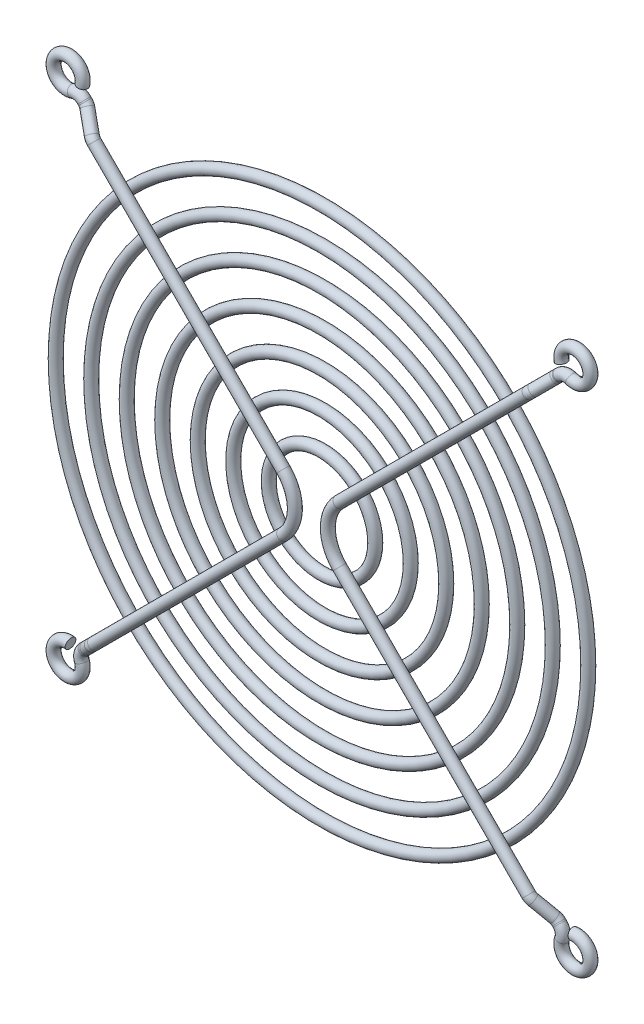
ISO-10303-21;
HEADER;
FILE_DESCRIPTION(('STEP AP214'),'2;1');
FILE_NAME('part.step','',(''),(''),'','','');
FILE_SCHEMA(('AUTOMOTIVE_DESIGN { 1 0 10303 214 1 1 1 1 }'));
ENDSEC;
DATA;
#1=APPLICATION_CONTEXT('core data for automotive mechanical design processes');
#2=APPLICATION_PROTOCOL_DEFINITION('international standard','automotive_design',2000,#1);
#3=PRODUCT_CONTEXT('',#1,'mechanical');
#4=PRODUCT('Part','Part','',(#3));
#5=PRODUCT_RELATED_PRODUCT_CATEGORY('part','',(#4));
#6=PRODUCT_DEFINITION_FORMATION('','',#4);
#7=PRODUCT_DEFINITION_CONTEXT('part definition',#1,'design');
#8=PRODUCT_DEFINITION('design','',#6,#7);
#9=PRODUCT_DEFINITION_SHAPE('','',#8);
#10=(LENGTH_UNIT() NAMED_UNIT(*) SI_UNIT(.MILLI.,.METRE.));
#11=(NAMED_UNIT(*) PLANE_ANGLE_UNIT() SI_UNIT($,.RADIAN.));
#12=(NAMED_UNIT(*) SI_UNIT($,.STERADIAN.) SOLID_ANGLE_UNIT());
#13=UNCERTAINTY_MEASURE_WITH_UNIT(LENGTH_MEASURE(1.E-05),#10,'distance_accuracy_value','');
#14=(GEOMETRIC_REPRESENTATION_CONTEXT(3) GLOBAL_UNCERTAINTY_ASSIGNED_CONTEXT((#13)) GLOBAL_UNIT_ASSIGNED_CONTEXT((#10,
#11,#12)) REPRESENTATION_CONTEXT('',''));
#15=CARTESIAN_POINT('',(0.,0.,0.));
#16=DIRECTION('',(0.,0.,1.));
#17=DIRECTION('',(1.,0.,0.));
#18=AXIS2_PLACEMENT_3D('',#15,#16,#17);
#19=CARTESIAN_POINT('',(35.4170650177825,-33.7272162009706,0.));
#20=DIRECTION('',(0.986723804404589,0.162407308398774,0.));
#21=DIRECTION('',(0.162407308398774,-0.986723804404589,0.));
#22=AXIS2_PLACEMENT_3D('',#19,#20,#21);
#23=PLANE('',#22);
#24=CARTESIAN_POINT('',(35.4170650177825,-33.7272162009706,0.));
#25=DIRECTION('',(-0.986723804404589,-0.162407308398774,0.));
#26=DIRECTION('',(0.162407308398774,-0.986723804404589,0.));
#27=AXIS2_PLACEMENT_3D('',#24,#25,#26);
#28=CIRCLE('',#27,0.75);
#29=CARTESIAN_POINT('',(35.5388704990816,-34.4672590542741,0.));
#30=VERTEX_POINT('',#29);
#31=EDGE_CURVE('E155',#30,#30,#28,.T.);
#32=ORIENTED_EDGE('',*,*,#31,.T.);
#33=EDGE_LOOP('',(#32));
#34=FACE_BOUND('',#33,.T.);
#35=ADVANCED_FACE('F143',(#34),#23,.F.);
#36=CARTESIAN_POINT('',(33.7560533293205,35.2738942612335,0.));
#37=DIRECTION('',(0.232246701837298,-0.972656912526559,0.));
#38=DIRECTION('',(-0.972656912526559,-0.232246701837298,0.));
#39=AXIS2_PLACEMENT_3D('',#36,#37,#38);
#40=PLANE('',#39);
#41=CARTESIAN_POINT('',(33.7560533293205,35.2738942612335,0.));
#42=DIRECTION('',(-0.232246701837298,0.972656912526559,0.));
#43=DIRECTION('',(-0.972656912526559,-0.232246701837298,0.));
#44=AXIS2_PLACEMENT_3D('',#41,#42,#43);
#45=CIRCLE('',#44,0.75);
#46=CARTESIAN_POINT('',(33.0265606449256,35.0997092348555,0.));
#47=VERTEX_POINT('',#46);
#48=EDGE_CURVE('E13',#47,#47,#45,.T.);
#49=ORIENTED_EDGE('',*,*,#48,.F.);
#50=EDGE_LOOP('',(#49));
#51=FACE_BOUND('',#50,.T.);
#52=ADVANCED_FACE('F161',(#51),#40,.T.);
#53=CARTESIAN_POINT('',(35.75,-35.75,0.));
#54=DIRECTION('',(0.,0.,1.));
#55=DIRECTION('',(-1.,0.,0.));
#56=AXIS2_PLACEMENT_3D('',#53,#54,#55);
#57=TOROIDAL_SURFACE('',#56,2.04999999999998,0.75);
#58=CARTESIAN_POINT('',(33.8236943839283,-35.0486821879557,0.));
#59=DIRECTION('',(-0.342106249777711,-0.939661276132538,0.));
#60=DIRECTION('',(0.939661276132539,-0.342106249777711,0.));
#61=AXIS2_PLACEMENT_3D('',#58,#59,#60);
#62=CIRCLE('',#61,0.75);
#63=CARTESIAN_POINT('',(34.5284403410277,-35.3052618752889,0.));
#64=VERTEX_POINT('',#63);
#65=EDGE_CURVE('E232',#64,#64,#62,.T.);
#66=ORIENTED_EDGE('',*,*,#65,.T.);
#67=EDGE_LOOP('',(#66));
#68=FACE_BOUND('',#67,.T.);
#69=ORIENTED_EDGE('',*,*,#31,.F.);
#70=EDGE_LOOP('',(#69));
#71=FACE_BOUND('',#70,.T.);
#72=ADVANCED_FACE('F163',(#68,#71),#57,.T.);
#73=CARTESIAN_POINT('',(32.4142024697295,-34.5355228132891,0.));
#74=DIRECTION('',(0.,0.,-1.));
#75=DIRECTION('',(1.,0.,0.));
#76=AXIS2_PLACEMENT_3D('',#73,#74,#75);
#77=TOROIDAL_SURFACE('',#76,1.49999999999998,0.75);
#78=CARTESIAN_POINT('',(33.4748626415095,-33.4748626415096,0.));
#79=DIRECTION('',(0.707106781186385,-0.70710678118671,0.));
#80=DIRECTION('',(0.70710678118671,0.707106781186386,0.));
#81=AXIS2_PLACEMENT_3D('',#78,#79,#80);
#82=CIRCLE('',#81,0.75);
#83=CARTESIAN_POINT('',(34.0051927273996,-32.9445325556198,0.));
#84=VERTEX_POINT('',#83);
#85=EDGE_CURVE('E229',#84,#84,#82,.T.);
#86=CARTESIAN_POINT('',(32.4142024697295,-34.5355228132891,0.));
#87=DIRECTION('',(0.,0.,-1.));
#88=DIRECTION('',(1.,0.,0.));
#89=AXIS2_PLACEMENT_3D('',#86,#87,#88);
#90=CIRCLE('',#89,2.24999999999998);
#91=EDGE_CURVE('',#84,#64,#90,.T.);
#92=ORIENTED_EDGE('',*,*,#85,.T.);
#93=ORIENTED_EDGE('',*,*,#65,.F.);
#94=ORIENTED_EDGE('',*,*,#91,.T.);
#95=ORIENTED_EDGE('',*,*,#91,.F.);
#96=EDGE_LOOP('',(#92,#94,#93,#95));
#97=FACE_BOUND('',#96,.T.);
#98=ADVANCED_FACE('F168',(#97),#77,.T.);
#99=CARTESIAN_POINT('',(33.4748626415095,-33.4748626415096,0.));
#100=DIRECTION('',(-0.707106781186403,0.707106781186691,0.));
#101=DIRECTION('',(0.707106781186692,0.707106781186404,0.));
#102=AXIS2_PLACEMENT_3D('',#99,#100,#101);
#103=CYLINDRICAL_SURFACE('',#102,0.75);
#104=CARTESIAN_POINT('',(33.3556075318585,-33.3556075318585,0.));
#105=DIRECTION('',(0.707106781186403,-0.707106781186692,0.));
#106=DIRECTION('',(0.707106781186692,0.707106781186404,0.));
#107=AXIS2_PLACEMENT_3D('',#104,#105,#106);
#108=CIRCLE('',#107,0.75);
#109=CARTESIAN_POINT('',(33.3556075318587,-33.3556075318583,-0.75));
#110=VERTEX_POINT('',#109);
#111=EDGE_CURVE('E234',#110,#110,#108,.T.);
#112=ORIENTED_EDGE('',*,*,#111,.T.);
#113=EDGE_LOOP('',(#112));
#114=FACE_BOUND('',#113,.T.);
#115=ORIENTED_EDGE('',*,*,#85,.F.);
#116=EDGE_LOOP('',(#115));
#117=FACE_BOUND('',#116,.T.);
#118=ADVANCED_FACE('F217',(#114,#117),#103,.T.);
#119=CARTESIAN_POINT('',(33.355607531858,-33.355607531859,1.5));
#120=DIRECTION('',(-0.707106781186693,-0.707106781186402,-4.36572074787497E-13));
#121=DIRECTION('',(-0.707106781186402,0.707106781186693,0.));
#122=AXIS2_PLACEMENT_3D('',#119,#120,#121);
#123=TOROIDAL_SURFACE('',#122,1.5,0.75);
#124=CARTESIAN_POINT('',(32.9088128371524,-32.9088128371524,0.139577638538332));
#125=DIRECTION('',(0.641309251378241,-0.641309251378246,-0.421242077899814));
#126=DIRECTION('',(0.707106781186564,0.707106781186532,0.));
#127=AXIS2_PLACEMENT_3D('',#124,#125,#126);
#128=CIRCLE('',#127,0.75);
#129=CARTESIAN_POINT('',(32.6854154897996,-32.6854154897991,-0.540633542192506));
#130=VERTEX_POINT('',#129);
#131=EDGE_CURVE('E240',#130,#130,#128,.T.);
#132=CARTESIAN_POINT('',(33.355607531858,-33.355607531859,1.5));
#133=DIRECTION('',(-0.707106781186693,-0.707106781186402,-4.36572074787497E-13));
#134=DIRECTION('',(-0.707106781186402,0.707106781186693,0.));
#135=AXIS2_PLACEMENT_3D('',#132,#133,#134);
#136=CIRCLE('',#135,2.25);
#137=EDGE_CURVE('',#130,#110,#136,.T.);
#138=ORIENTED_EDGE('',*,*,#131,.T.);
#139=ORIENTED_EDGE('',*,*,#111,.F.);
#140=ORIENTED_EDGE('',*,*,#137,.T.);
#141=ORIENTED_EDGE('',*,*,#137,.F.);
#142=EDGE_LOOP('',(#138,#140,#139,#141));
#143=FACE_BOUND('',#142,.T.);
#144=ADVANCED_FACE('F213',(#143),#123,.T.);
#145=CARTESIAN_POINT('',(32.9088128371524,-32.9088128371524,0.13957763853833));
#146=DIRECTION('',(-0.641309251378243,0.641309251378244,0.421242077899815));
#147=DIRECTION('',(0.707106781186548,0.707106781186547,0.));
#148=AXIS2_PLACEMENT_3D('',#145,#146,#147);
#149=CYLINDRICAL_SURFACE('',#148,0.75);
#150=CARTESIAN_POINT('',(31.0501689447603,-31.0501689447603,1.36042236146167));
#151=DIRECTION('',(0.641309251378243,-0.641309251378244,-0.421242077899815));
#152=DIRECTION('',(0.707106781186562,0.707106781186533,0.));
#153=AXIS2_PLACEMENT_3D('',#150,#151,#152);
#154=CIRCLE('',#153,0.75);
#155=CARTESIAN_POINT('',(31.2735662921134,-31.2735662921133,2.04063354219252));
#156=VERTEX_POINT('',#155);
#157=EDGE_CURVE('E243',#156,#156,#154,.T.);
#158=ORIENTED_EDGE('',*,*,#157,.T.);
#159=EDGE_LOOP('',(#158));
#160=FACE_BOUND('',#159,.T.);
#161=ORIENTED_EDGE('',*,*,#131,.F.);
#162=EDGE_LOOP('',(#161));
#163=FACE_BOUND('',#162,.T.);
#164=ADVANCED_FACE('F209',(#160,#163),#149,.T.);
#165=CARTESIAN_POINT('',(30.6033742500542,-30.6033742500542,0.));
#166=DIRECTION('',(0.707106781186545,0.70710678118655,0.));
#167=DIRECTION('',(0.70710678118655,-0.707106781186545,0.));
#168=AXIS2_PLACEMENT_3D('',#165,#166,#167);
#169=TOROIDAL_SURFACE('',#168,1.5,0.75);
#170=CARTESIAN_POINT('',(30.6033742500542,-30.6033742500542,1.5));
#171=DIRECTION('',(0.70710678118655,-0.707106781186545,0.));
#172=DIRECTION('',(0.707106781186546,0.70710678118655,0.));
#173=AXIS2_PLACEMENT_3D('',#170,#171,#172);
#174=CIRCLE('',#173,0.75);
#175=CARTESIAN_POINT('',(30.6033742500542,-30.6033742500542,2.25));
#176=VERTEX_POINT('',#175);
#177=EDGE_CURVE('E246',#176,#176,#174,.T.);
#178=CARTESIAN_POINT('',(30.6033742500542,-30.6033742500542,0.));
#179=DIRECTION('',(0.707106781186545,0.70710678118655,0.));
#180=DIRECTION('',(0.70710678118655,-0.707106781186545,0.));
#181=AXIS2_PLACEMENT_3D('',#178,#179,#180);
#182=CIRCLE('',#181,2.25);
#183=EDGE_CURVE('',#176,#156,#182,.T.);
#184=ORIENTED_EDGE('',*,*,#177,.T.);
#185=ORIENTED_EDGE('',*,*,#157,.F.);
#186=ORIENTED_EDGE('',*,*,#183,.T.);
#187=ORIENTED_EDGE('',*,*,#183,.F.);
#188=EDGE_LOOP('',(#184,#186,#185,#187));
#189=FACE_BOUND('',#188,.T.);
#190=ADVANCED_FACE('F205',(#189),#169,.T.);
#191=CARTESIAN_POINT('',(30.6033742500542,-30.6033742500542,1.5));
#192=DIRECTION('',(-0.707106781186548,0.707106781186547,0.));
#193=DIRECTION('',(0.707106781186547,0.707106781186548,0.));
#194=AXIS2_PLACEMENT_3D('',#191,#192,#193);
#195=CYLINDRICAL_SURFACE('',#194,0.75);
#196=CARTESIAN_POINT('',(3.96761484590761,-3.96761484590759,1.5));
#197=DIRECTION('',(0.707106781186547,-0.707106781186548,0.));
#198=DIRECTION('',(0.707106781186548,0.707106781186548,0.));
#199=AXIS2_PLACEMENT_3D('',#196,#197,#198);
#200=CIRCLE('',#199,0.75);
#201=CARTESIAN_POINT('',(3.4372847600177,-4.4979449317975,1.5));
#202=VERTEX_POINT('',#201);
#203=EDGE_CURVE('E249',#202,#202,#200,.T.);
#204=ORIENTED_EDGE('',*,*,#203,.T.);
#205=EDGE_LOOP('',(#204));
#206=FACE_BOUND('',#205,.T.);
#207=ORIENTED_EDGE('',*,*,#177,.F.);
#208=EDGE_LOOP('',(#207));
#209=FACE_BOUND('',#208,.T.);
#210=ADVANCED_FACE('F201',(#206,#209),#195,.T.);
#211=CARTESIAN_POINT('',(7.93522969181521,0.,1.5));
#212=DIRECTION('',(0.,0.,1.));
#213=DIRECTION('',(-1.,0.,0.));
#214=AXIS2_PLACEMENT_3D('',#211,#212,#213);
#215=TOROIDAL_SURFACE('',#214,5.61105472535535,0.75);
#216=CARTESIAN_POINT('',(3.96761484590762,3.9676148459076,1.5));
#217=DIRECTION('',(-0.707106781186548,-0.707106781186547,0.));
#218=DIRECTION('',(0.707106781186548,-0.707106781186548,0.));
#219=AXIS2_PLACEMENT_3D('',#216,#217,#218);
#220=CIRCLE('',#219,0.75);
#221=CARTESIAN_POINT('',(3.43728476001771,4.4979449317975,1.5));
#222=VERTEX_POINT('',#221);
#223=EDGE_CURVE('E252',#222,#222,#220,.T.);
#224=CARTESIAN_POINT('',(7.93522969181521,0.,1.5));
#225=DIRECTION('',(0.,0.,1.));
#226=DIRECTION('',(-1.,0.,0.));
#227=AXIS2_PLACEMENT_3D('',#224,#225,#226);
#228=CIRCLE('',#227,6.36105472535535);
#229=EDGE_CURVE('',#222,#202,#228,.T.);
#230=ORIENTED_EDGE('',*,*,#223,.T.);
#231=ORIENTED_EDGE('',*,*,#203,.F.);
#232=ORIENTED_EDGE('',*,*,#229,.T.);
#233=ORIENTED_EDGE('',*,*,#229,.F.);
#234=EDGE_LOOP('',(#230,#232,#231,#233));
#235=FACE_BOUND('',#234,.T.);
#236=ADVANCED_FACE('F197',(#235),#215,.T.);
#237=CARTESIAN_POINT('',(3.96761484590762,3.96761484590759,1.5));
#238=DIRECTION('',(0.707106781186548,0.707106781186548,0.));
#239=DIRECTION('',(0.707106781186548,-0.707106781186548,0.));
#240=AXIS2_PLACEMENT_3D('',#237,#238,#239);
#241=CYLINDRICAL_SURFACE('',#240,0.75);
#242=CARTESIAN_POINT('',(30.6033742500542,30.6033742500542,1.5));
#243=DIRECTION('',(-0.707106781186548,-0.707106781186547,0.));
#244=DIRECTION('',(0.707106781186547,-0.707106781186548,0.));
#245=AXIS2_PLACEMENT_3D('',#242,#243,#244);
#246=CIRCLE('',#245,0.75);
#247=CARTESIAN_POINT('',(30.6033742500542,30.6033742500542,2.25));
#248=VERTEX_POINT('',#247);
#249=EDGE_CURVE('E255',#248,#248,#246,.T.);
#250=ORIENTED_EDGE('',*,*,#249,.T.);
#251=EDGE_LOOP('',(#250));
#252=FACE_BOUND('',#251,.T.);
#253=ORIENTED_EDGE('',*,*,#223,.F.);
#254=EDGE_LOOP('',(#253));
#255=FACE_BOUND('',#254,.T.);
#256=ADVANCED_FACE('F193',(#252,#255),#241,.T.);
#257=CARTESIAN_POINT('',(30.6033742500542,30.6033742500542,0.));
#258=DIRECTION('',(0.707106781186549,-0.707106781186546,0.));
#259=DIRECTION('',(-0.707106781186546,-0.707106781186549,0.));
#260=AXIS2_PLACEMENT_3D('',#257,#258,#259);
#261=TOROIDAL_SURFACE('',#260,1.5,0.75);
#262=CARTESIAN_POINT('',(31.0501689447604,31.0501689447603,1.36042236146164));
#263=DIRECTION('',(-0.64130925137823,-0.641309251378232,0.421242077899853));
#264=DIRECTION('',(0.707106781186563,-0.707106781186533,0.));
#265=AXIS2_PLACEMENT_3D('',#262,#263,#264);
#266=CIRCLE('',#265,0.75);
#267=CARTESIAN_POINT('',(31.2735662921134,31.2735662921134,2.04063354219246));
#268=VERTEX_POINT('',#267);
#269=EDGE_CURVE('E258',#268,#268,#266,.T.);
#270=CARTESIAN_POINT('',(30.6033742500542,30.6033742500542,0.));
#271=DIRECTION('',(0.707106781186549,-0.707106781186546,0.));
#272=DIRECTION('',(-0.707106781186546,-0.707106781186549,0.));
#273=AXIS2_PLACEMENT_3D('',#270,#271,#272);
#274=CIRCLE('',#273,2.25);
#275=EDGE_CURVE('',#268,#248,#274,.T.);
#276=ORIENTED_EDGE('',*,*,#269,.T.);
#277=ORIENTED_EDGE('',*,*,#249,.F.);
#278=ORIENTED_EDGE('',*,*,#275,.T.);
#279=ORIENTED_EDGE('',*,*,#275,.F.);
#280=EDGE_LOOP('',(#276,#278,#277,#279));
#281=FACE_BOUND('',#280,.T.);
#282=ADVANCED_FACE('F189',(#281),#261,.T.);
#283=CARTESIAN_POINT('',(31.0501689447604,31.0501689447603,1.36042236146164));
#284=DIRECTION('',(0.64130925137823,0.64130925137823,-0.421242077899855));
#285=DIRECTION('',(0.707106781186548,-0.707106781186548,0.));
#286=AXIS2_PLACEMENT_3D('',#283,#284,#285);
#287=CYLINDRICAL_SURFACE('',#286,0.75);
#288=CARTESIAN_POINT('',(32.9088128371522,32.9088128371521,0.139577638538349));
#289=DIRECTION('',(-0.641309251378231,-0.64130925137823,0.421242077899855));
#290=DIRECTION('',(0.707106781186562,-0.707106781186533,0.));
#291=AXIS2_PLACEMENT_3D('',#288,#289,#290);
#292=CIRCLE('',#291,0.75);
#293=CARTESIAN_POINT('',(32.6854154897991,32.6854154897991,-0.540633542192478));
#294=VERTEX_POINT('',#293);
#295=EDGE_CURVE('E261',#294,#294,#292,.T.);
#296=ORIENTED_EDGE('',*,*,#295,.T.);
#297=EDGE_LOOP('',(#296));
#298=FACE_BOUND('',#297,.T.);
#299=ORIENTED_EDGE('',*,*,#269,.F.);
#300=EDGE_LOOP('',(#299));
#301=FACE_BOUND('',#300,.T.);
#302=ADVANCED_FACE('F185',(#298,#301),#287,.T.);
#303=CARTESIAN_POINT('',(33.3556075318583,33.3556075318583,1.5));
#304=DIRECTION('',(-0.707106781186547,0.707106781186547,0.));
#305=DIRECTION('',(0.707106781186548,0.707106781186548,0.));
#306=AXIS2_PLACEMENT_3D('',#303,#304,#305);
#307=TOROIDAL_SURFACE('',#306,1.5,0.75);
#308=CARTESIAN_POINT('',(33.3556075318583,33.3556075318583,0.));
#309=DIRECTION('',(-0.707106781186548,-0.707106781186547,0.));
#310=DIRECTION('',(0.707106781186547,-0.707106781186548,0.));
#311=AXIS2_PLACEMENT_3D('',#308,#309,#310);
#312=CIRCLE('',#311,0.75);
#313=CARTESIAN_POINT('',(33.3556075318583,33.3556075318583,-0.749999999999999));
#314=VERTEX_POINT('',#313);
#315=EDGE_CURVE('E264',#314,#314,#312,.T.);
#316=CARTESIAN_POINT('',(33.3556075318583,33.3556075318583,1.5));
#317=DIRECTION('',(-0.707106781186547,0.707106781186547,0.));
#318=DIRECTION('',(0.707106781186548,0.707106781186548,0.));
#319=AXIS2_PLACEMENT_3D('',#316,#317,#318);
#320=CIRCLE('',#319,2.25);
#321=EDGE_CURVE('',#314,#294,#320,.T.);
#322=ORIENTED_EDGE('',*,*,#315,.T.);
#323=ORIENTED_EDGE('',*,*,#295,.F.);
#324=ORIENTED_EDGE('',*,*,#321,.T.);
#325=ORIENTED_EDGE('',*,*,#321,.F.);
#326=EDGE_LOOP('',(#322,#324,#323,#325));
#327=FACE_BOUND('',#326,.T.);
#328=ADVANCED_FACE('F181',(#327),#307,.T.);
#329=CARTESIAN_POINT('',(33.3556075318583,33.3556075318583,0.));
#330=DIRECTION('',(0.707106781186548,0.707106781186548,0.));
#331=DIRECTION('',(0.707106781186548,-0.707106781186548,0.));
#332=AXIS2_PLACEMENT_3D('',#329,#330,#331);
#333=CYLINDRICAL_SURFACE('',#332,0.75);
#334=CARTESIAN_POINT('',(33.4748626415093,33.4748626415093,0.));
#335=DIRECTION('',(-0.707106781186548,-0.707106781186547,0.));
#336=DIRECTION('',(0.707106781186547,-0.707106781186548,0.));
#337=AXIS2_PLACEMENT_3D('',#334,#335,#336);
#338=CIRCLE('',#337,0.75);
#339=CARTESIAN_POINT('',(32.9445325556194,34.0051927273992,0.));
#340=VERTEX_POINT('',#339);
#341=EDGE_CURVE('E267',#340,#340,#338,.T.);
#342=ORIENTED_EDGE('',*,*,#341,.T.);
#343=EDGE_LOOP('',(#342));
#344=FACE_BOUND('',#343,.T.);
#345=ORIENTED_EDGE('',*,*,#315,.F.);
#346=EDGE_LOOP('',(#345));
#347=FACE_BOUND('',#346,.T.);
#348=ADVANCED_FACE('F177',(#344,#347),#333,.T.);
#349=CARTESIAN_POINT('',(34.5355228132891,32.4142024697295,0.));
#350=DIRECTION('',(0.,0.,1.));
#351=DIRECTION('',(-1.,0.,0.));
#352=AXIS2_PLACEMENT_3D('',#349,#350,#351);
#353=TOROIDAL_SURFACE('',#352,1.49999999999998,0.75);
#354=CARTESIAN_POINT('',(35.0486821879557,33.8236943839283,0.));
#355=DIRECTION('',(-0.93966127613254,0.342106249777707,0.));
#356=DIRECTION('',(-0.342106249777707,-0.93966127613254,0.));
#357=AXIS2_PLACEMENT_3D('',#354,#355,#356);
#358=CIRCLE('',#357,0.75);
#359=CARTESIAN_POINT('',(35.305261875289,34.5284403410277,0.));
#360=VERTEX_POINT('',#359);
#361=EDGE_CURVE('E150',#360,#360,#358,.T.);
#362=CARTESIAN_POINT('',(34.5355228132891,32.4142024697295,0.));
#363=DIRECTION('',(0.,0.,1.));
#364=DIRECTION('',(-1.,0.,0.));
#365=AXIS2_PLACEMENT_3D('',#362,#363,#364);
#366=CIRCLE('',#365,2.24999999999998);
#367=EDGE_CURVE('',#360,#340,#366,.T.);
#368=ORIENTED_EDGE('',*,*,#361,.T.);
#369=ORIENTED_EDGE('',*,*,#341,.F.);
#370=ORIENTED_EDGE('',*,*,#367,.T.);
#371=ORIENTED_EDGE('',*,*,#367,.F.);
#372=EDGE_LOOP('',(#368,#370,#369,#371));
#373=FACE_BOUND('',#372,.T.);
#374=ADVANCED_FACE('F174',(#373),#353,.T.);
#375=CARTESIAN_POINT('',(35.75,35.75,0.));
#376=DIRECTION('',(0.,0.,-1.));
#377=DIRECTION('',(1.,0.,0.));
#378=AXIS2_PLACEMENT_3D('',#375,#376,#377);
#379=TOROIDAL_SURFACE('',#378,2.05000000000003,0.75);
#380=ORIENTED_EDGE('',*,*,#48,.T.);
#381=EDGE_LOOP('',(#380));
#382=FACE_BOUND('',#381,.T.);
#383=ORIENTED_EDGE('',*,*,#361,.F.);
#384=EDGE_LOOP('',(#383));
#385=FACE_BOUND('',#384,.T.);
#386=ADVANCED_FACE('F158',(#382,#385),#379,.T.);
#387=CLOSED_SHELL('',(#35,#52,#72,#98,#118,#144,#164,#190,#210,#236,#256,#282,#302,#328,#348,
#374,#386));
#388=MANIFOLD_SOLID_BREP('B2',#387);
#389=CARTESIAN_POINT('',(-35.4170650177825,-33.7272162009706,0.));
#390=DIRECTION('',(-0.986723804404589,0.162407308398774,0.));
#391=DIRECTION('',(-0.162407308398774,-0.986723804404589,0.));
#392=AXIS2_PLACEMENT_3D('',#389,#390,#391);
#393=PLANE('',#392);
#394=CARTESIAN_POINT('',(-35.4170650177825,-33.7272162009706,0.));
#395=DIRECTION('',(-0.986723804404589,0.162407308398774,0.));
#396=DIRECTION('',(-0.162407308398774,-0.986723804404589,0.));
#397=AXIS2_PLACEMENT_3D('',#394,#395,#396);
#398=CIRCLE('',#397,0.75);
#399=CARTESIAN_POINT('',(-35.5388704990816,-34.4672590542741,0.));
#400=VERTEX_POINT('',#399);
#401=EDGE_CURVE('E415',#400,#400,#398,.T.);
#402=ORIENTED_EDGE('',*,*,#401,.F.);
#403=EDGE_LOOP('',(#402));
#404=FACE_BOUND('',#403,.T.);
#405=ADVANCED_FACE('F403',(#404),#393,.F.);
#406=CARTESIAN_POINT('',(-33.7560533293205,35.2738942612335,0.));
#407=DIRECTION('',(-0.232246701837298,-0.972656912526559,0.));
#408=DIRECTION('',(0.972656912526559,-0.232246701837298,0.));
#409=AXIS2_PLACEMENT_3D('',#406,#407,#408);
#410=PLANE('',#409);
#411=CARTESIAN_POINT('',(-33.7560533293205,35.2738942612335,0.));
#412=DIRECTION('',(-0.232246701837298,-0.972656912526559,0.));
#413=DIRECTION('',(0.972656912526559,-0.232246701837298,0.));
#414=AXIS2_PLACEMENT_3D('',#411,#412,#413);
#415=CIRCLE('',#414,0.75);
#416=CARTESIAN_POINT('',(-33.0265606449256,35.0997092348555,0.));
#417=VERTEX_POINT('',#416);
#418=EDGE_CURVE('E141',#417,#417,#415,.T.);
#419=ORIENTED_EDGE('',*,*,#418,.T.);
#420=EDGE_LOOP('',(#419));
#421=FACE_BOUND('',#420,.T.);
#422=ADVANCED_FACE('F418',(#421),#410,.T.);
#423=CARTESIAN_POINT('',(-35.75,-35.75,0.));
#424=DIRECTION('',(0.,0.,1.));
#425=DIRECTION('',(1.,0.,0.));
#426=AXIS2_PLACEMENT_3D('',#423,#424,#425);
#427=TOROIDAL_SURFACE('',#426,2.04999999999998,0.75);
#428=CARTESIAN_POINT('',(-33.8236943839283,-35.0486821879557,0.));
#429=DIRECTION('',(-0.342106249777711,0.939661276132538,0.));
#430=DIRECTION('',(-0.939661276132539,-0.342106249777711,0.));
#431=AXIS2_PLACEMENT_3D('',#428,#429,#430);
#432=CIRCLE('',#431,0.75);
#433=CARTESIAN_POINT('',(-34.5284403410277,-35.3052618752889,0.));
#434=VERTEX_POINT('',#433);
#435=EDGE_CURVE('E465',#434,#434,#432,.T.);
#436=ORIENTED_EDGE('',*,*,#435,.F.);
#437=EDGE_LOOP('',(#436));
#438=FACE_BOUND('',#437,.T.);
#439=ORIENTED_EDGE('',*,*,#401,.T.);
#440=EDGE_LOOP('',(#439));
#441=FACE_BOUND('',#440,.T.);
#442=ADVANCED_FACE('F469',(#438,#441),#427,.T.);
#443=CARTESIAN_POINT('',(-32.4142024697295,-34.5355228132891,0.));
#444=DIRECTION('',(0.,0.,-1.));
#445=DIRECTION('',(-1.,0.,0.));
#446=AXIS2_PLACEMENT_3D('',#443,#444,#445);
#447=TOROIDAL_SURFACE('',#446,1.49999999999998,0.75);
#448=CARTESIAN_POINT('',(-33.4748626415095,-33.4748626415096,0.));
#449=DIRECTION('',(0.707106781186385,0.70710678118671,0.));
#450=DIRECTION('',(-0.70710678118671,0.707106781186386,0.));
#451=AXIS2_PLACEMENT_3D('',#448,#449,#450);
#452=CIRCLE('',#451,0.75);
#453=CARTESIAN_POINT('',(-34.0051927273996,-32.9445325556198,0.));
#454=VERTEX_POINT('',#453);
#455=EDGE_CURVE('E462',#454,#454,#452,.T.);
#456=CARTESIAN_POINT('',(-32.4142024697295,-34.5355228132891,0.));
#457=DIRECTION('',(0.,0.,-1.));
#458=DIRECTION('',(-1.,0.,0.));
#459=AXIS2_PLACEMENT_3D('',#456,#457,#458);
#460=CIRCLE('',#459,2.24999999999998);
#461=EDGE_CURVE('',#434,#454,#460,.T.);
#462=ORIENTED_EDGE('',*,*,#435,.T.);
#463=ORIENTED_EDGE('',*,*,#455,.F.);
#464=ORIENTED_EDGE('',*,*,#461,.T.);
#465=ORIENTED_EDGE('',*,*,#461,.F.);
#466=EDGE_LOOP('',(#462,#464,#463,#465));
#467=FACE_BOUND('',#466,.T.);
#468=ADVANCED_FACE('F471',(#467),#447,.T.);
#469=CARTESIAN_POINT('',(-33.4748626415095,-33.4748626415096,0.));
#470=DIRECTION('',(0.707106781186403,0.707106781186691,0.));
#471=DIRECTION('',(-0.707106781186692,0.707106781186404,0.));
#472=AXIS2_PLACEMENT_3D('',#469,#470,#471);
#473=CYLINDRICAL_SURFACE('',#472,0.75);
#474=CARTESIAN_POINT('',(-33.3556075318585,-33.3556075318585,0.));
#475=DIRECTION('',(0.707106781186403,0.707106781186692,0.));
#476=DIRECTION('',(-0.707106781186692,0.707106781186404,0.));
#477=AXIS2_PLACEMENT_3D('',#474,#475,#476);
#478=CIRCLE('',#477,0.75);
#479=CARTESIAN_POINT('',(-33.3556075318587,-33.3556075318583,-0.75));
#480=VERTEX_POINT('',#479);
#481=EDGE_CURVE('E459',#480,#480,#478,.T.);
#482=ORIENTED_EDGE('',*,*,#481,.F.);
#483=EDGE_LOOP('',(#482));
#484=FACE_BOUND('',#483,.T.);
#485=ORIENTED_EDGE('',*,*,#455,.T.);
#486=EDGE_LOOP('',(#485));
#487=FACE_BOUND('',#486,.T.);
#488=ADVANCED_FACE('F478',(#484,#487),#473,.T.);
#489=CARTESIAN_POINT('',(-33.355607531858,-33.355607531859,1.5));
#490=DIRECTION('',(0.707106781186693,-0.707106781186402,-4.36572074787497E-13));
#491=DIRECTION('',(0.707106781186402,0.707106781186693,0.));
#492=AXIS2_PLACEMENT_3D('',#489,#490,#491);
#493=TOROIDAL_SURFACE('',#492,1.5,0.75);
#494=CARTESIAN_POINT('',(-32.9088128371524,-32.9088128371524,0.139577638538332));
#495=DIRECTION('',(0.641309251378241,0.641309251378246,0.421242077899814));
#496=DIRECTION('',(-0.707106781186564,0.707106781186532,0.));
#497=AXIS2_PLACEMENT_3D('',#494,#495,#496);
#498=CIRCLE('',#497,0.75);
#499=CARTESIAN_POINT('',(-32.6854154897996,-32.6854154897991,-0.540633542192506));
#500=VERTEX_POINT('',#499);
#501=EDGE_CURVE('E456',#500,#500,#498,.T.);
#502=CARTESIAN_POINT('',(-33.355607531858,-33.355607531859,1.5));
#503=DIRECTION('',(0.707106781186693,-0.707106781186402,-4.36572074787497E-13));
#504=DIRECTION('',(0.707106781186402,0.707106781186693,0.));
#505=AXIS2_PLACEMENT_3D('',#502,#503,#504);
#506=CIRCLE('',#505,2.25);
#507=EDGE_CURVE('',#480,#500,#506,.T.);
#508=ORIENTED_EDGE('',*,*,#481,.T.);
#509=ORIENTED_EDGE('',*,*,#501,.F.);
#510=ORIENTED_EDGE('',*,*,#507,.T.);
#511=ORIENTED_EDGE('',*,*,#507,.F.);
#512=EDGE_LOOP('',(#508,#510,#509,#511));
#513=FACE_BOUND('',#512,.T.);
#514=ADVANCED_FACE('F485',(#513),#493,.T.);
#515=CARTESIAN_POINT('',(-32.9088128371524,-32.9088128371524,0.13957763853833));
#516=DIRECTION('',(0.641309251378243,0.641309251378244,0.421242077899815));
#517=DIRECTION('',(-0.707106781186548,0.707106781186547,0.));
#518=AXIS2_PLACEMENT_3D('',#515,#516,#517);
#519=CYLINDRICAL_SURFACE('',#518,0.75);
#520=CARTESIAN_POINT('',(-31.0501689447603,-31.0501689447603,1.36042236146167));
#521=DIRECTION('',(0.641309251378243,0.641309251378244,0.421242077899815));
#522=DIRECTION('',(-0.707106781186562,0.707106781186533,0.));
#523=AXIS2_PLACEMENT_3D('',#520,#521,#522);
#524=CIRCLE('',#523,0.75);
#525=CARTESIAN_POINT('',(-31.2735662921134,-31.2735662921133,2.04063354219252));
#526=VERTEX_POINT('',#525);
#527=EDGE_CURVE('E453',#526,#526,#524,.T.);
#528=ORIENTED_EDGE('',*,*,#527,.F.);
#529=EDGE_LOOP('',(#528));
#530=FACE_BOUND('',#529,.T.);
#531=ORIENTED_EDGE('',*,*,#501,.T.);
#532=EDGE_LOOP('',(#531));
#533=FACE_BOUND('',#532,.T.);
#534=ADVANCED_FACE('F489',(#530,#533),#519,.T.);
#535=CARTESIAN_POINT('',(-30.6033742500542,-30.6033742500542,0.));
#536=DIRECTION('',(-0.707106781186545,0.70710678118655,0.));
#537=DIRECTION('',(-0.70710678118655,-0.707106781186545,0.));
#538=AXIS2_PLACEMENT_3D('',#535,#536,#537);
#539=TOROIDAL_SURFACE('',#538,1.5,0.75);
#540=CARTESIAN_POINT('',(-30.6033742500542,-30.6033742500542,1.5));
#541=DIRECTION('',(0.70710678118655,0.707106781186545,0.));
#542=DIRECTION('',(-0.707106781186546,0.70710678118655,0.));
#543=AXIS2_PLACEMENT_3D('',#540,#541,#542);
#544=CIRCLE('',#543,0.75);
#545=CARTESIAN_POINT('',(-30.6033742500542,-30.6033742500542,2.25));
#546=VERTEX_POINT('',#545);
#547=EDGE_CURVE('E450',#546,#546,#544,.T.);
#548=CARTESIAN_POINT('',(-30.6033742500542,-30.6033742500542,0.));
#549=DIRECTION('',(-0.707106781186545,0.70710678118655,0.));
#550=DIRECTION('',(-0.70710678118655,-0.707106781186545,0.));
#551=AXIS2_PLACEMENT_3D('',#548,#549,#550);
#552=CIRCLE('',#551,2.25);
#553=EDGE_CURVE('',#526,#546,#552,.T.);
#554=ORIENTED_EDGE('',*,*,#527,.T.);
#555=ORIENTED_EDGE('',*,*,#547,.F.);
#556=ORIENTED_EDGE('',*,*,#553,.T.);
#557=ORIENTED_EDGE('',*,*,#553,.F.);
#558=EDGE_LOOP('',(#554,#556,#555,#557));
#559=FACE_BOUND('',#558,.T.);
#560=ADVANCED_FACE('F493',(#559),#539,.T.);
#561=CARTESIAN_POINT('',(-30.6033742500542,-30.6033742500542,1.5));
#562=DIRECTION('',(0.707106781186548,0.707106781186547,0.));
#563=DIRECTION('',(-0.707106781186547,0.707106781186548,0.));
#564=AXIS2_PLACEMENT_3D('',#561,#562,#563);
#565=CYLINDRICAL_SURFACE('',#564,0.75);
#566=CARTESIAN_POINT('',(-3.96761484590761,-3.96761484590759,1.5));
#567=DIRECTION('',(0.707106781186547,0.707106781186548,0.));
#568=DIRECTION('',(-0.707106781186548,0.707106781186548,0.));
#569=AXIS2_PLACEMENT_3D('',#566,#567,#568);
#570=CIRCLE('',#569,0.75);
#571=CARTESIAN_POINT('',(-3.4372847600177,-4.4979449317975,1.5));
#572=VERTEX_POINT('',#571);
#573=EDGE_CURVE('E447',#572,#572,#570,.T.);
#574=ORIENTED_EDGE('',*,*,#573,.F.);
#575=EDGE_LOOP('',(#574));
#576=FACE_BOUND('',#575,.T.);
#577=ORIENTED_EDGE('',*,*,#547,.T.);
#578=EDGE_LOOP('',(#577));
#579=FACE_BOUND('',#578,.T.);
#580=ADVANCED_FACE('F497',(#576,#579),#565,.T.);
#581=CARTESIAN_POINT('',(-7.93522969181521,0.,1.5));
#582=DIRECTION('',(0.,0.,1.));
#583=DIRECTION('',(1.,0.,0.));
#584=AXIS2_PLACEMENT_3D('',#581,#582,#583);
#585=TOROIDAL_SURFACE('',#584,5.61105472535535,0.75);
#586=CARTESIAN_POINT('',(-3.96761484590762,3.9676148459076,1.5));
#587=DIRECTION('',(-0.707106781186548,0.707106781186547,0.));
#588=DIRECTION('',(-0.707106781186548,-0.707106781186548,0.));
#589=AXIS2_PLACEMENT_3D('',#586,#587,#588);
#590=CIRCLE('',#589,0.75);
#591=CARTESIAN_POINT('',(-3.43728476001771,4.4979449317975,1.5));
#592=VERTEX_POINT('',#591);
#593=EDGE_CURVE('E444',#592,#592,#590,.T.);
#594=CARTESIAN_POINT('',(-7.93522969181521,0.,1.5));
#595=DIRECTION('',(0.,0.,1.));
#596=DIRECTION('',(1.,0.,0.));
#597=AXIS2_PLACEMENT_3D('',#594,#595,#596);
#598=CIRCLE('',#597,6.36105472535535);
#599=EDGE_CURVE('',#572,#592,#598,.T.);
#600=ORIENTED_EDGE('',*,*,#573,.T.);
#601=ORIENTED_EDGE('',*,*,#593,.F.);
#602=ORIENTED_EDGE('',*,*,#599,.T.);
#603=ORIENTED_EDGE('',*,*,#599,.F.);
#604=EDGE_LOOP('',(#600,#602,#601,#603));
#605=FACE_BOUND('',#604,.T.);
#606=ADVANCED_FACE('F501',(#605),#585,.T.);
#607=CARTESIAN_POINT('',(-3.96761484590762,3.96761484590759,1.5));
#608=DIRECTION('',(-0.707106781186548,0.707106781186548,0.));
#609=DIRECTION('',(-0.707106781186548,-0.707106781186548,0.));
#610=AXIS2_PLACEMENT_3D('',#607,#608,#609);
#611=CYLINDRICAL_SURFACE('',#610,0.75);
#612=CARTESIAN_POINT('',(-30.6033742500542,30.6033742500542,1.5));
#613=DIRECTION('',(-0.707106781186548,0.707106781186547,0.));
#614=DIRECTION('',(-0.707106781186547,-0.707106781186548,0.));
#615=AXIS2_PLACEMENT_3D('',#612,#613,#614);
#616=CIRCLE('',#615,0.75);
#617=CARTESIAN_POINT('',(-30.6033742500542,30.6033742500542,2.25));
#618=VERTEX_POINT('',#617);
#619=EDGE_CURVE('E441',#618,#618,#616,.T.);
#620=ORIENTED_EDGE('',*,*,#619,.F.);
#621=EDGE_LOOP('',(#620));
#622=FACE_BOUND('',#621,.T.);
#623=ORIENTED_EDGE('',*,*,#593,.T.);
#624=EDGE_LOOP('',(#623));
#625=FACE_BOUND('',#624,.T.);
#626=ADVANCED_FACE('F505',(#622,#625),#611,.T.);
#627=CARTESIAN_POINT('',(-30.6033742500542,30.6033742500542,0.));
#628=DIRECTION('',(-0.707106781186549,-0.707106781186546,0.));
#629=DIRECTION('',(0.707106781186546,-0.707106781186549,0.));
#630=AXIS2_PLACEMENT_3D('',#627,#628,#629);
#631=TOROIDAL_SURFACE('',#630,1.5,0.75);
#632=CARTESIAN_POINT('',(-31.0501689447604,31.0501689447603,1.36042236146164));
#633=DIRECTION('',(-0.64130925137823,0.641309251378232,-0.421242077899853));
#634=DIRECTION('',(-0.707106781186563,-0.707106781186533,0.));
#635=AXIS2_PLACEMENT_3D('',#632,#633,#634);
#636=CIRCLE('',#635,0.75);
#637=CARTESIAN_POINT('',(-31.2735662921134,31.2735662921134,2.04063354219246));
#638=VERTEX_POINT('',#637);
#639=EDGE_CURVE('E438',#638,#638,#636,.T.);
#640=CARTESIAN_POINT('',(-30.6033742500542,30.6033742500542,0.));
#641=DIRECTION('',(-0.707106781186549,-0.707106781186546,0.));
#642=DIRECTION('',(0.707106781186546,-0.707106781186549,0.));
#643=AXIS2_PLACEMENT_3D('',#640,#641,#642);
#644=CIRCLE('',#643,2.25);
#645=EDGE_CURVE('',#618,#638,#644,.T.);
#646=ORIENTED_EDGE('',*,*,#619,.T.);
#647=ORIENTED_EDGE('',*,*,#639,.F.);
#648=ORIENTED_EDGE('',*,*,#645,.T.);
#649=ORIENTED_EDGE('',*,*,#645,.F.);
#650=EDGE_LOOP('',(#646,#648,#647,#649));
#651=FACE_BOUND('',#650,.T.);
#652=ADVANCED_FACE('F509',(#651),#631,.T.);
#653=CARTESIAN_POINT('',(-31.0501689447604,31.0501689447603,1.36042236146164));
#654=DIRECTION('',(-0.64130925137823,0.64130925137823,-0.421242077899855));
#655=DIRECTION('',(-0.707106781186548,-0.707106781186548,0.));
#656=AXIS2_PLACEMENT_3D('',#653,#654,#655);
#657=CYLINDRICAL_SURFACE('',#656,0.75);
#658=CARTESIAN_POINT('',(-32.9088128371522,32.9088128371521,0.139577638538349));
#659=DIRECTION('',(-0.641309251378231,0.64130925137823,-0.421242077899855));
#660=DIRECTION('',(-0.707106781186562,-0.707106781186533,0.));
#661=AXIS2_PLACEMENT_3D('',#658,#659,#660);
#662=CIRCLE('',#661,0.75);
#663=CARTESIAN_POINT('',(-32.6854154897991,32.6854154897991,-0.540633542192478));
#664=VERTEX_POINT('',#663);
#665=EDGE_CURVE('E435',#664,#664,#662,.T.);
#666=ORIENTED_EDGE('',*,*,#665,.F.);
#667=EDGE_LOOP('',(#666));
#668=FACE_BOUND('',#667,.T.);
#669=ORIENTED_EDGE('',*,*,#639,.T.);
#670=EDGE_LOOP('',(#669));
#671=FACE_BOUND('',#670,.T.);
#672=ADVANCED_FACE('F513',(#668,#671),#657,.T.);
#673=CARTESIAN_POINT('',(-33.3556075318583,33.3556075318583,1.5));
#674=DIRECTION('',(0.707106781186547,0.707106781186547,0.));
#675=DIRECTION('',(-0.707106781186548,0.707106781186548,0.));
#676=AXIS2_PLACEMENT_3D('',#673,#674,#675);
#677=TOROIDAL_SURFACE('',#676,1.5,0.75);
#678=CARTESIAN_POINT('',(-33.3556075318583,33.3556075318583,0.));
#679=DIRECTION('',(-0.707106781186548,0.707106781186547,0.));
#680=DIRECTION('',(-0.707106781186547,-0.707106781186548,0.));
#681=AXIS2_PLACEMENT_3D('',#678,#679,#680);
#682=CIRCLE('',#681,0.75);
#683=CARTESIAN_POINT('',(-33.3556075318583,33.3556075318583,-0.749999999999999));
#684=VERTEX_POINT('',#683);
#685=EDGE_CURVE('E430',#684,#684,#682,.T.);
#686=CARTESIAN_POINT('',(-33.3556075318583,33.3556075318583,1.5));
#687=DIRECTION('',(0.707106781186547,0.707106781186547,0.));
#688=DIRECTION('',(-0.707106781186548,0.707106781186548,0.));
#689=AXIS2_PLACEMENT_3D('',#686,#687,#688);
#690=CIRCLE('',#689,2.25);
#691=EDGE_CURVE('',#664,#684,#690,.T.);
#692=ORIENTED_EDGE('',*,*,#665,.T.);
#693=ORIENTED_EDGE('',*,*,#685,.F.);
#694=ORIENTED_EDGE('',*,*,#691,.T.);
#695=ORIENTED_EDGE('',*,*,#691,.F.);
#696=EDGE_LOOP('',(#692,#694,#693,#695));
#697=FACE_BOUND('',#696,.T.);
#698=ADVANCED_FACE('F517',(#697),#677,.T.);
#699=CARTESIAN_POINT('',(-33.3556075318583,33.3556075318583,0.));
#700=DIRECTION('',(-0.707106781186548,0.707106781186548,0.));
#701=DIRECTION('',(-0.707106781186548,-0.707106781186548,0.));
#702=AXIS2_PLACEMENT_3D('',#699,#700,#701);
#703=CYLINDRICAL_SURFACE('',#702,0.75);
#704=CARTESIAN_POINT('',(-33.4748626415093,33.4748626415093,0.));
#705=DIRECTION('',(-0.707106781186548,0.707106781186547,0.));
#706=DIRECTION('',(-0.707106781186547,-0.707106781186548,0.));
#707=AXIS2_PLACEMENT_3D('',#704,#705,#706);
#708=CIRCLE('',#707,0.75);
#709=CARTESIAN_POINT('',(-32.9445325556194,34.0051927273992,0.));
#710=VERTEX_POINT('',#709);
#711=EDGE_CURVE('E428',#710,#710,#708,.T.);
#712=ORIENTED_EDGE('',*,*,#711,.F.);
#713=EDGE_LOOP('',(#712));
#714=FACE_BOUND('',#713,.T.);
#715=ORIENTED_EDGE('',*,*,#685,.T.);
#716=EDGE_LOOP('',(#715));
#717=FACE_BOUND('',#716,.T.);
#718=ADVANCED_FACE('F521',(#714,#717),#703,.T.);
#719=CARTESIAN_POINT('',(-34.5355228132891,32.4142024697295,0.));
#720=DIRECTION('',(0.,0.,1.));
#721=DIRECTION('',(1.,0.,0.));
#722=AXIS2_PLACEMENT_3D('',#719,#720,#721);
#723=TOROIDAL_SURFACE('',#722,1.49999999999998,0.75);
#724=CARTESIAN_POINT('',(-35.0486821879557,33.8236943839283,0.));
#725=DIRECTION('',(-0.93966127613254,-0.342106249777707,0.));
#726=DIRECTION('',(0.342106249777707,-0.93966127613254,0.));
#727=AXIS2_PLACEMENT_3D('',#724,#725,#726);
#728=CIRCLE('',#727,0.75);
#729=CARTESIAN_POINT('',(-35.305261875289,34.5284403410277,0.));
#730=VERTEX_POINT('',#729);
#731=EDGE_CURVE('E410',#730,#730,#728,.T.);
#732=CARTESIAN_POINT('',(-34.5355228132891,32.4142024697295,0.));
#733=DIRECTION('',(0.,0.,1.));
#734=DIRECTION('',(1.,0.,0.));
#735=AXIS2_PLACEMENT_3D('',#732,#733,#734);
#736=CIRCLE('',#735,2.24999999999998);
#737=EDGE_CURVE('',#710,#730,#736,.T.);
#738=ORIENTED_EDGE('',*,*,#711,.T.);
#739=ORIENTED_EDGE('',*,*,#731,.F.);
#740=ORIENTED_EDGE('',*,*,#737,.T.);
#741=ORIENTED_EDGE('',*,*,#737,.F.);
#742=EDGE_LOOP('',(#738,#740,#739,#741));
#743=FACE_BOUND('',#742,.T.);
#744=ADVANCED_FACE('F423',(#743),#723,.T.);
#745=CARTESIAN_POINT('',(-35.75,35.75,0.));
#746=DIRECTION('',(0.,0.,-1.));
#747=DIRECTION('',(-1.,0.,0.));
#748=AXIS2_PLACEMENT_3D('',#745,#746,#747);
#749=TOROIDAL_SURFACE('',#748,2.05000000000003,0.75);
#750=ORIENTED_EDGE('',*,*,#418,.F.);
#751=EDGE_LOOP('',(#750));
#752=FACE_BOUND('',#751,.T.);
#753=ORIENTED_EDGE('',*,*,#731,.T.);
#754=EDGE_LOOP('',(#753));
#755=FACE_BOUND('',#754,.T.);
#756=ADVANCED_FACE('F420',(#752,#755),#749,.T.);
#757=CLOSED_SHELL('',(#405,#422,#442,#468,#488,#514,#534,#560,#580,#606,#626,#652,#672,#698,
#718,#744,#756));
#758=MANIFOLD_SOLID_BREP('B7',#757);
#759=CARTESIAN_POINT('',(0.,0.,0.));
#760=DIRECTION('',(0.,0.,1.));
#761=DIRECTION('',(1.,0.,0.));
#762=AXIS2_PLACEMENT_3D('',#759,#760,#761);
#763=TOROIDAL_SURFACE('',#762,37.5,0.750000000000001);
#764=CARTESIAN_POINT('',(37.5,0.,0.));
#765=DIRECTION('',(0.,1.,0.));
#766=DIRECTION('',(-1.,0.,0.));
#767=AXIS2_PLACEMENT_3D('',#764,#765,#766);
#768=CIRCLE('',#767,0.750000000000001);
#769=CARTESIAN_POINT('',(38.25,0.,0.));
#770=VERTEX_POINT('',#769);
#771=EDGE_CURVE('E402',#770,#770,#768,.T.);
#772=CARTESIAN_POINT('',(0.,0.,0.));
#773=DIRECTION('',(0.,0.,1.));
#774=DIRECTION('',(1.,0.,0.));
#775=AXIS2_PLACEMENT_3D('',#772,#773,#774);
#776=CIRCLE('',#775,38.25);
#777=EDGE_CURVE('',#770,#770,#776,.T.);
#778=ORIENTED_EDGE('',*,*,#771,.T.);
#779=ORIENTED_EDGE('',*,*,#771,.F.);
#780=ORIENTED_EDGE('',*,*,#777,.T.);
#781=ORIENTED_EDGE('',*,*,#777,.F.);
#782=EDGE_LOOP('',(#778,#780,#779,#781));
#783=FACE_BOUND('',#782,.T.);
#784=ADVANCED_FACE('F663',(#783),#763,.T.);
#785=CLOSED_SHELL('',(#784));
#786=MANIFOLD_SOLID_BREP('B135',#785);
#787=CARTESIAN_POINT('',(0.,0.,0.));
#788=DIRECTION('',(0.,0.,1.));
#789=DIRECTION('',(1.,0.,0.));
#790=AXIS2_PLACEMENT_3D('',#787,#788,#789);
#791=TOROIDAL_SURFACE('',#790,32.5,0.750000000000001);
#792=CARTESIAN_POINT('',(32.5,0.,0.));
#793=DIRECTION('',(0.,1.,0.));
#794=DIRECTION('',(-1.,0.,0.));
#795=AXIS2_PLACEMENT_3D('',#792,#793,#794);
#796=CIRCLE('',#795,0.750000000000001);
#797=CARTESIAN_POINT('',(33.25,0.,0.));
#798=VERTEX_POINT('',#797);
#799=EDGE_CURVE('E662',#798,#798,#796,.T.);
#800=CARTESIAN_POINT('',(0.,0.,0.));
#801=DIRECTION('',(0.,0.,1.));
#802=DIRECTION('',(1.,0.,0.));
#803=AXIS2_PLACEMENT_3D('',#800,#801,#802);
#804=CIRCLE('',#803,33.25);
#805=EDGE_CURVE('',#798,#798,#804,.T.);
#806=ORIENTED_EDGE('',*,*,#799,.T.);
#807=ORIENTED_EDGE('',*,*,#799,.F.);
#808=ORIENTED_EDGE('',*,*,#805,.T.);
#809=ORIENTED_EDGE('',*,*,#805,.F.);
#810=EDGE_LOOP('',(#806,#808,#807,#809));
#811=FACE_BOUND('',#810,.T.);
#812=ADVANCED_FACE('F687',(#811),#791,.T.);
#813=CLOSED_SHELL('',(#812));
#814=MANIFOLD_SOLID_BREP('B397',#813);
#815=CARTESIAN_POINT('',(0.,0.,0.));
#816=DIRECTION('',(0.,0.,1.));
#817=DIRECTION('',(1.,0.,0.));
#818=AXIS2_PLACEMENT_3D('',#815,#816,#817);
#819=TOROIDAL_SURFACE('',#818,27.5,0.750000000000001);
#820=CARTESIAN_POINT('',(27.5,0.,0.));
#821=DIRECTION('',(0.,1.,0.));
#822=DIRECTION('',(-1.,0.,0.));
#823=AXIS2_PLACEMENT_3D('',#820,#821,#822);
#824=CIRCLE('',#823,0.750000000000001);
#825=CARTESIAN_POINT('',(28.25,0.,0.));
#826=VERTEX_POINT('',#825);
#827=EDGE_CURVE('E686',#826,#826,#824,.T.);
#828=CARTESIAN_POINT('',(0.,0.,0.));
#829=DIRECTION('',(0.,0.,1.));
#830=DIRECTION('',(1.,0.,0.));
#831=AXIS2_PLACEMENT_3D('',#828,#829,#830);
#832=CIRCLE('',#831,28.25);
#833=EDGE_CURVE('',#826,#826,#832,.T.);
#834=ORIENTED_EDGE('',*,*,#827,.T.);
#835=ORIENTED_EDGE('',*,*,#827,.F.);
#836=ORIENTED_EDGE('',*,*,#833,.T.);
#837=ORIENTED_EDGE('',*,*,#833,.F.);
#838=EDGE_LOOP('',(#834,#836,#835,#837));
#839=FACE_BOUND('',#838,.T.);
#840=ADVANCED_FACE('F711',(#839),#819,.T.);
#841=CLOSED_SHELL('',(#840));
#842=MANIFOLD_SOLID_BREP('B657',#841);
#843=CARTESIAN_POINT('',(0.,0.,0.));
#844=DIRECTION('',(0.,0.,1.));
#845=DIRECTION('',(1.,0.,0.));
#846=AXIS2_PLACEMENT_3D('',#843,#844,#845);
#847=TOROIDAL_SURFACE('',#846,22.5,0.750000000000001);
#848=CARTESIAN_POINT('',(22.5,0.,0.));
#849=DIRECTION('',(0.,1.,0.));
#850=DIRECTION('',(-1.,0.,0.));
#851=AXIS2_PLACEMENT_3D('',#848,#849,#850);
#852=CIRCLE('',#851,0.750000000000001);
#853=CARTESIAN_POINT('',(23.25,0.,0.));
#854=VERTEX_POINT('',#853);
#855=EDGE_CURVE('E710',#854,#854,#852,.T.);
#856=CARTESIAN_POINT('',(0.,0.,0.));
#857=DIRECTION('',(0.,0.,1.));
#858=DIRECTION('',(1.,0.,0.));
#859=AXIS2_PLACEMENT_3D('',#856,#857,#858);
#860=CIRCLE('',#859,23.25);
#861=EDGE_CURVE('',#854,#854,#860,.T.);
#862=ORIENTED_EDGE('',*,*,#855,.T.);
#863=ORIENTED_EDGE('',*,*,#855,.F.);
#864=ORIENTED_EDGE('',*,*,#861,.T.);
#865=ORIENTED_EDGE('',*,*,#861,.F.);
#866=EDGE_LOOP('',(#862,#864,#863,#865));
#867=FACE_BOUND('',#866,.T.);
#868=ADVANCED_FACE('F735',(#867),#847,.T.);
#869=CLOSED_SHELL('',(#868));
#870=MANIFOLD_SOLID_BREP('B681',#869);
#871=CARTESIAN_POINT('',(0.,0.,0.));
#872=DIRECTION('',(0.,0.,1.));
#873=DIRECTION('',(1.,0.,0.));
#874=AXIS2_PLACEMENT_3D('',#871,#872,#873);
#875=TOROIDAL_SURFACE('',#874,17.5,0.750000000000001);
#876=CARTESIAN_POINT('',(17.5,0.,0.));
#877=DIRECTION('',(0.,1.,0.));
#878=DIRECTION('',(-1.,0.,0.));
#879=AXIS2_PLACEMENT_3D('',#876,#877,#878);
#880=CIRCLE('',#879,0.750000000000001);
#881=CARTESIAN_POINT('',(18.25,0.,0.));
#882=VERTEX_POINT('',#881);
#883=EDGE_CURVE('E734',#882,#882,#880,.T.);
#884=CARTESIAN_POINT('',(0.,0.,0.));
#885=DIRECTION('',(0.,0.,1.));
#886=DIRECTION('',(1.,0.,0.));
#887=AXIS2_PLACEMENT_3D('',#884,#885,#886);
#888=CIRCLE('',#887,18.25);
#889=EDGE_CURVE('',#882,#882,#888,.T.);
#890=ORIENTED_EDGE('',*,*,#883,.T.);
#891=ORIENTED_EDGE('',*,*,#883,.F.);
#892=ORIENTED_EDGE('',*,*,#889,.T.);
#893=ORIENTED_EDGE('',*,*,#889,.F.);
#894=EDGE_LOOP('',(#890,#892,#891,#893));
#895=FACE_BOUND('',#894,.T.);
#896=ADVANCED_FACE('F759',(#895),#875,.T.);
#897=CLOSED_SHELL('',(#896));
#898=MANIFOLD_SOLID_BREP('B705',#897);
#899=CARTESIAN_POINT('',(0.,0.,0.));
#900=DIRECTION('',(0.,0.,1.));
#901=DIRECTION('',(1.,0.,0.));
#902=AXIS2_PLACEMENT_3D('',#899,#900,#901);
#903=TOROIDAL_SURFACE('',#902,12.5,0.750000000000001);
#904=CARTESIAN_POINT('',(12.5,0.,0.));
#905=DIRECTION('',(0.,1.,0.));
#906=DIRECTION('',(-1.,0.,0.));
#907=AXIS2_PLACEMENT_3D('',#904,#905,#906);
#908=CIRCLE('',#907,0.750000000000001);
#909=CARTESIAN_POINT('',(13.25,0.,0.));
#910=VERTEX_POINT('',#909);
#911=EDGE_CURVE('E758',#910,#910,#908,.T.);
#912=CARTESIAN_POINT('',(0.,0.,0.));
#913=DIRECTION('',(0.,0.,1.));
#914=DIRECTION('',(1.,0.,0.));
#915=AXIS2_PLACEMENT_3D('',#912,#913,#914);
#916=CIRCLE('',#915,13.25);
#917=EDGE_CURVE('',#910,#910,#916,.T.);
#918=ORIENTED_EDGE('',*,*,#911,.T.);
#919=ORIENTED_EDGE('',*,*,#911,.F.);
#920=ORIENTED_EDGE('',*,*,#917,.T.);
#921=ORIENTED_EDGE('',*,*,#917,.F.);
#922=EDGE_LOOP('',(#918,#920,#919,#921));
#923=FACE_BOUND('',#922,.T.);
#924=ADVANCED_FACE('F782',(#923),#903,.T.);
#925=CLOSED_SHELL('',(#924));
#926=MANIFOLD_SOLID_BREP('B729',#925);
#927=CARTESIAN_POINT('',(0.,0.,0.));
#928=DIRECTION('',(0.,0.,1.));
#929=DIRECTION('',(1.,0.,0.));
#930=AXIS2_PLACEMENT_3D('',#927,#928,#929);
#931=TOROIDAL_SURFACE('',#930,7.5,0.75);
#932=CARTESIAN_POINT('',(7.49999999999999,0.,0.));
#933=DIRECTION('',(0.,1.,0.));
#934=DIRECTION('',(-1.,0.,0.));
#935=AXIS2_PLACEMENT_3D('',#932,#933,#934);
#936=CIRCLE('',#935,0.75);
#937=CARTESIAN_POINT('',(8.24999999999999,0.,0.));
#938=VERTEX_POINT('',#937);
#939=EDGE_CURVE('E781',#938,#938,#936,.T.);
#940=CARTESIAN_POINT('',(0.,0.,0.));
#941=DIRECTION('',(0.,0.,1.));
#942=DIRECTION('',(1.,0.,0.));
#943=AXIS2_PLACEMENT_3D('',#940,#941,#942);
#944=CIRCLE('',#943,8.25);
#945=EDGE_CURVE('',#938,#938,#944,.T.);
#946=ORIENTED_EDGE('',*,*,#939,.T.);
#947=ORIENTED_EDGE('',*,*,#939,.F.);
#948=ORIENTED_EDGE('',*,*,#945,.T.);
#949=ORIENTED_EDGE('',*,*,#945,.F.);
#950=EDGE_LOOP('',(#946,#948,#947,#949));
#951=FACE_BOUND('',#950,.T.);
#952=ADVANCED_FACE('F798',(#951),#931,.T.);
#953=CLOSED_SHELL('',(#952));
#954=MANIFOLD_SOLID_BREP('B753',#953);
#955=ADVANCED_BREP_SHAPE_REPRESENTATION('',(#18,#388,#758,#786,#814,#842,#870,#898,#926,#954),#14);
#956=SHAPE_DEFINITION_REPRESENTATION(#9,#955);
ENDSEC;
END-ISO-10303-21;
